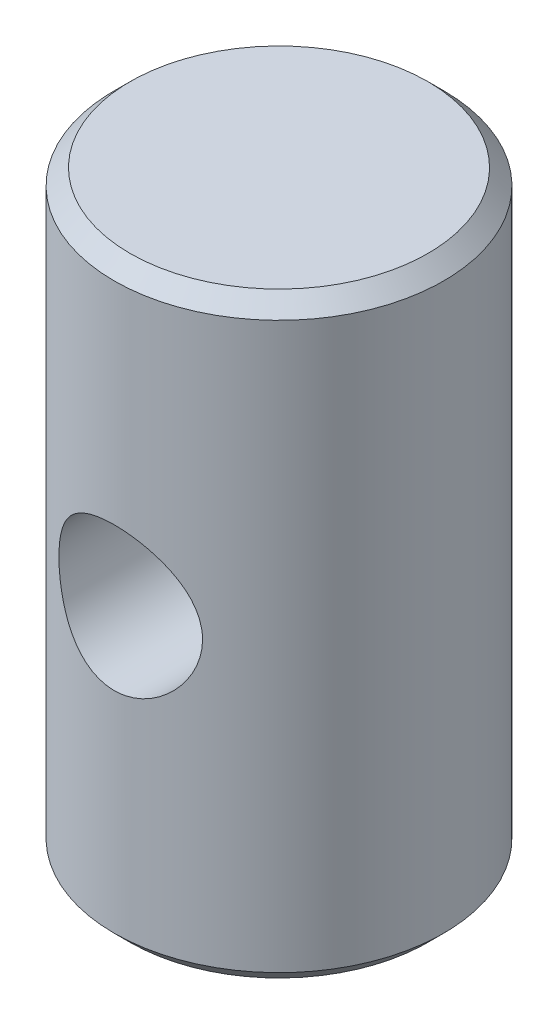
ISO-10303-21;
HEADER;
FILE_DESCRIPTION(('STEP AP214'),'2;1');
FILE_NAME('part.step','',(''),(''),'','','');
FILE_SCHEMA(('AUTOMOTIVE_DESIGN { 1 0 10303 214 1 1 1 1 }'));
ENDSEC;
DATA;
#1=APPLICATION_CONTEXT('core data for automotive mechanical design processes');
#2=APPLICATION_PROTOCOL_DEFINITION('international standard','automotive_design',2000,#1);
#3=PRODUCT_CONTEXT('',#1,'mechanical');
#4=PRODUCT('Part','Part','',(#3));
#5=PRODUCT_RELATED_PRODUCT_CATEGORY('part','',(#4));
#6=PRODUCT_DEFINITION_FORMATION('','',#4);
#7=PRODUCT_DEFINITION_CONTEXT('part definition',#1,'design');
#8=PRODUCT_DEFINITION('design','',#6,#7);
#9=PRODUCT_DEFINITION_SHAPE('','',#8);
#10=(LENGTH_UNIT() NAMED_UNIT(*) SI_UNIT(.MILLI.,.METRE.));
#11=(NAMED_UNIT(*) PLANE_ANGLE_UNIT() SI_UNIT($,.RADIAN.));
#12=(NAMED_UNIT(*) SI_UNIT($,.STERADIAN.) SOLID_ANGLE_UNIT());
#13=UNCERTAINTY_MEASURE_WITH_UNIT(LENGTH_MEASURE(1.E-05),#10,'distance_accuracy_value','');
#14=(GEOMETRIC_REPRESENTATION_CONTEXT(3) GLOBAL_UNCERTAINTY_ASSIGNED_CONTEXT((#13)) GLOBAL_UNIT_ASSIGNED_CONTEXT((#10,
#11,#12)) REPRESENTATION_CONTEXT('',''));
#15=CARTESIAN_POINT('',(0.,0.,0.));
#16=DIRECTION('',(0.,0.,1.));
#17=DIRECTION('',(1.,0.,0.));
#18=AXIS2_PLACEMENT_3D('',#15,#16,#17);
#19=CARTESIAN_POINT('',(0.,14.351,0.));
#20=DIRECTION('',(0.,-1.,0.));
#21=DIRECTION('',(0.,0.,-1.00000000000001));
#22=AXIS2_PLACEMENT_3D('',#19,#20,#21);
#23=CYLINDRICAL_SURFACE('',#22,3.9624);
#24=CARTESIAN_POINT('',(1.7272,7.1628,3.56614552703619));
#25=CARTESIAN_POINT('',(1.72719589741112,7.07113387059166,3.56614993077741));
#26=CARTESIAN_POINT('',(1.7198563547776,6.9793146178966,3.56973092522894));
#27=CARTESIAN_POINT('',(1.69081256466766,6.79836471975493,3.58357547788537));
#28=CARTESIAN_POINT('',(1.66907105976062,6.70924167628412,3.59385636739065));
#29=CARTESIAN_POINT('',(1.61224827694549,6.53662551523054,3.6197002139196));
#30=CARTESIAN_POINT('',(1.57722487269375,6.4531097970809,3.63524022403528));
#31=CARTESIAN_POINT('',(1.49500578565154,6.29316182054083,3.6698165066083));
#32=CARTESIAN_POINT('',(1.44781218552928,6.21672835321407,3.68885218069736));
#33=CARTESIAN_POINT('',(1.33915027419396,6.06785473138359,3.72972629681705));
#34=CARTESIAN_POINT('',(1.27697890078481,5.99595508122913,3.75166530796737));
#35=CARTESIAN_POINT('',(1.14159970539789,5.8631987124269,3.79505136644031));
#36=CARTESIAN_POINT('',(1.06838740960764,5.80234649235768,3.81649821025789));
#37=CARTESIAN_POINT('',(0.908670114004449,5.69056161394339,3.85772570091536));
#38=CARTESIAN_POINT('',(0.821694106038829,5.64024944000791,3.8773759773678));
#39=CARTESIAN_POINT('',(0.639499839563152,5.55520813096962,3.91154996359956));
#40=CARTESIAN_POINT('',(0.544285594873898,5.52047145763201,3.92607615260837));
#41=CARTESIAN_POINT('',(0.354004474453539,5.46956458647761,3.94764982511966));
#42=CARTESIAN_POINT('',(0.259231279574775,5.45245895379762,3.95507241461706));
#43=CARTESIAN_POINT('',(0.0678890738924124,5.43426453734702,3.96297326142524));
#44=CARTESIAN_POINT('',(-0.0286791157575748,5.43316860182497,3.96345461947812));
#45=CARTESIAN_POINT('',(-0.214019931292419,5.44656196520325,3.95763057708475));
#46=CARTESIAN_POINT('',(-0.302883957933032,5.46001982846568,3.95177430819682));
#47=CARTESIAN_POINT('',(-0.476944676567913,5.50035407791297,3.9345633932956));
#48=CARTESIAN_POINT('',(-0.562141096735375,5.52723145683962,3.92320834049806));
#49=CARTESIAN_POINT('',(-0.728026639089416,5.5939421456383,3.89586603541677));
#50=CARTESIAN_POINT('',(-0.808626905603861,5.63396730489782,3.87981059847104));
#51=CARTESIAN_POINT('',(-0.962179080061302,5.72563783228495,3.84461178823216));
#52=CARTESIAN_POINT('',(-1.03512820484004,5.77728740754322,3.82546729765475));
#53=CARTESIAN_POINT('',(-1.17721181969115,5.89529983549194,3.78426569350377));
#54=CARTESIAN_POINT('',(-1.24563357525797,5.96248324454073,3.76209779908373));
#55=CARTESIAN_POINT('',(-1.37056544109138,6.10737251655165,3.71840738174161));
#56=CARTESIAN_POINT('',(-1.42707005457811,6.18508320819918,3.69688516054489));
#57=CARTESIAN_POINT('',(-1.52864446774681,6.35260056060402,3.6560878177876));
#58=CARTESIAN_POINT('',(-1.57318542786003,6.44275959623804,3.63693230997906));
#59=CARTESIAN_POINT('',(-1.64615514374342,6.63035261029733,3.60449719801011));
#60=CARTESIAN_POINT('',(-1.67459667664862,6.72778074997144,3.59121293604018));
#61=CARTESIAN_POINT('',(-1.71265446245399,6.91998586667292,3.57321211924261));
#62=CARTESIAN_POINT('',(-1.72343422801932,7.01448193413677,3.5679676487184));
#63=CARTESIAN_POINT('',(-1.72930635611275,7.20405814926641,3.56512687568415));
#64=CARTESIAN_POINT('',(-1.72440506063363,7.29913804528603,3.56752748122483));
#65=CARTESIAN_POINT('',(-1.70011832298708,7.4798545126876,3.57915692676073));
#66=CARTESIAN_POINT('',(-1.68181579551822,7.56567392560942,3.58787477116406));
#67=CARTESIAN_POINT('',(-1.63271771102619,7.73293532205738,3.61048078266554));
#68=CARTESIAN_POINT('',(-1.60191904401185,7.81437621015467,3.62437023678315));
#69=CARTESIAN_POINT('',(-1.52720876846257,7.97459431983546,3.65649623494317));
#70=CARTESIAN_POINT('',(-1.48277877423513,8.05309568427869,3.67489747406087));
#71=CARTESIAN_POINT('',(-1.38256674795294,8.20192765054499,3.71375937788474));
#72=CARTESIAN_POINT('',(-1.32677949731933,8.27225447280262,3.73422098712416));
#73=CARTESIAN_POINT('',(-1.19948482874215,8.40938735909963,3.77713548868492));
#74=CARTESIAN_POINT('',(-1.12701063383753,8.47529586406847,3.79960069661502));
#75=CARTESIAN_POINT('',(-0.971535731074503,8.59420328023159,3.84229423811627));
#76=CARTESIAN_POINT('',(-0.888533778841651,8.64720066317279,3.86252230672896));
#77=CARTESIAN_POINT('',(-0.71336397284965,8.73892270332071,3.89868757505322));
#78=CARTESIAN_POINT('',(-0.621139909518709,8.77755209321189,3.91459595172678));
#79=CARTESIAN_POINT('',(-0.430623283302369,8.83843900311843,3.94010004882491));
#80=CARTESIAN_POINT('',(-0.332334757521398,8.86070728991486,3.949699920259));
#81=CARTESIAN_POINT('',(-0.140461012272615,8.88679276605566,3.96098741868396));
#82=CARTESIAN_POINT('',(-0.0470781868625263,8.89187193505369,3.96321592377826));
#83=CARTESIAN_POINT('',(0.139194491913484,8.88689964312438,3.96104868747176));
#84=CARTESIAN_POINT('',(0.232084442924306,8.87685130073712,3.9566543113793));
#85=CARTESIAN_POINT('',(0.410738348901372,8.84281299069729,3.94203210863178));
#86=CARTESIAN_POINT('',(0.496638051959682,8.81941893219931,3.9320539492743));
#87=CARTESIAN_POINT('',(0.663238778514841,8.76003495200585,3.90740654114817));
#88=CARTESIAN_POINT('',(0.743938862312734,8.72404276103657,3.89273644727282));
#89=CARTESIAN_POINT('',(0.901932977314789,8.6386613837307,3.8592680887012));
#90=CARTESIAN_POINT('',(0.978901999050526,8.58873436390756,3.84031159534644));
#91=CARTESIAN_POINT('',(1.12370588773836,8.47765374175666,3.80046684162582));
#92=CARTESIAN_POINT('',(1.19153699805237,8.41649554650857,3.77957779269373));
#93=CARTESIAN_POINT('',(1.32148064662441,8.2792666195578,3.73622039367742));
#94=CARTESIAN_POINT('',(1.38277531468479,8.20241879921603,3.71375182625651));
#95=CARTESIAN_POINT('',(1.49175885005103,8.03888803959137,3.67133506488779));
#96=CARTESIAN_POINT('',(1.53943955533864,7.95219924366032,3.6513883868714));
#97=CARTESIAN_POINT('',(1.61960506634972,7.77101173405566,3.6165475054073));
#98=CARTESIAN_POINT('',(1.65207959254431,7.67650778789674,3.60165672165856));
#99=CARTESIAN_POINT('',(1.70023951426616,7.4826606357442,3.57917968442231));
#100=CARTESIAN_POINT('',(1.71598123416852,7.38333484894709,3.57156893429836));
#101=CARTESIAN_POINT('',(1.72438769192046,7.26337632757507,3.56750597176857));
#102=CARTESIAN_POINT('',(1.72544131653242,7.24328107414503,3.5669968427177));
#103=CARTESIAN_POINT('',(1.72684792846381,7.2030596765425,3.56631613319409));
#104=CARTESIAN_POINT('',(1.72720090109186,7.18293353173113,3.56614455979928));
#105=CARTESIAN_POINT('',(1.7272,7.1628,3.56614552703619));
#106=B_SPLINE_CURVE_WITH_KNOTS('',3,(#24,#25,#26,#27,#28,#29,#30,#31,#32,#33,#34,#35,#36,#37,
#38,#39,#40,#41,#42,#43,#44,#45,#46,#47,#48,#49,#50,#51,#52,#53,#54,#55,#56,#57,#58,#59,#60,#61,
#62,#63,#64,#65,#66,#67,#68,#69,#70,#71,#72,#73,#74,#75,#76,#77,#78,#79,#80,#81,#82,#83,#84,#85,
#86,#87,#88,#89,#90,#91,#92,#93,#94,#95,#96,#97,#98,#99,#100,#101,#102,#103,#104,#105),
.UNSPECIFIED.,.T.,.F.,(4,2,2,2,2,2,2,2,2,2,2,2,2,2,2,2,2,2,2,2,2,2,2,2,2,2,2,2,2,2,2,2,2,2,2,2,
2,2,2,2,4),(0.,0.27491360060961,0.550541186246354,0.824981319003142,1.09937451834223,
1.39076193437484,1.68226774023017,1.98784235201367,2.29326891166307,2.5814948127249,
2.8695919553817,3.13853317485298,3.40749429286321,3.68056864002003,3.9537419781475,
4.24770338801559,4.54180009242742,4.84730969142455,5.15257648487916,5.43678031040862,
5.72086920808197,5.98422984023226,6.24765605680785,6.52269943356456,6.79786947721351,
7.0979920914505,7.39815021311259,7.7002644872138,8.00217976991365,8.28138332266198,
8.5605293254123,8.82809027882379,9.09569945222211,9.37555849602337,9.65553224235743,
9.9566345983025,10.2579170977655,10.5594029742113,10.8598707724349,10.9202514788341,
10.9806334512913),.UNSPECIFIED.);
#107=CARTESIAN_POINT('',(1.7272,7.1628,3.56614552703619));
#108=VERTEX_POINT('',#107);
#109=EDGE_CURVE('E40',#108,#108,#106,.T.);
#110=ORIENTED_EDGE('',*,*,#109,.T.);
#111=EDGE_LOOP('',(#110));
#112=FACE_BOUND('',#111,.T.);
#113=CARTESIAN_POINT('',(0.,0.381000000000003,0.));
#114=DIRECTION('',(0.,1.,0.));
#115=DIRECTION('',(0.,0.,1.00000000000001));
#116=AXIS2_PLACEMENT_3D('',#113,#114,#115);
#117=CIRCLE('',#116,3.9624);
#118=CARTESIAN_POINT('',(0.,0.381000000000003,3.96240000000002));
#119=VERTEX_POINT('',#118);
#120=EDGE_CURVE('E67',#119,#119,#117,.T.);
#121=ORIENTED_EDGE('',*,*,#120,.T.);
#122=EDGE_LOOP('',(#121));
#123=FACE_BOUND('',#122,.T.);
#124=CARTESIAN_POINT('',(0.,13.97,0.));
#125=DIRECTION('',(0.,1.,0.));
#126=DIRECTION('',(0.,0.,1.00000000000001));
#127=AXIS2_PLACEMENT_3D('',#124,#125,#126);
#128=CIRCLE('',#127,3.9624);
#129=CARTESIAN_POINT('',(0.,13.97,3.96240000000002));
#130=VERTEX_POINT('',#129);
#131=EDGE_CURVE('E63',#130,#130,#128,.F.);
#132=ORIENTED_EDGE('',*,*,#131,.T.);
#133=EDGE_LOOP('',(#132));
#134=FACE_BOUND('',#133,.T.);
#135=ADVANCED_FACE('F36',(#112,#123,#134),#23,.T.);
#136=CARTESIAN_POINT('',(0.,14.351,0.));
#137=DIRECTION('',(0.,1.,0.));
#138=DIRECTION('',(0.,0.,1.00000000000001));
#139=AXIS2_PLACEMENT_3D('',#136,#137,#138);
#140=PLANE('',#139);
#141=CARTESIAN_POINT('',(0.,14.351,0.));
#142=DIRECTION('',(0.,1.,0.));
#143=DIRECTION('',(0.,0.,1.00000000000001));
#144=AXIS2_PLACEMENT_3D('',#141,#142,#143);
#145=CIRCLE('',#144,3.5814);
#146=CARTESIAN_POINT('',(0.,14.351,3.58140000000002));
#147=VERTEX_POINT('',#146);
#148=EDGE_CURVE('E11',#147,#147,#145,.T.);
#149=ORIENTED_EDGE('',*,*,#148,.T.);
#150=EDGE_LOOP('',(#149));
#151=FACE_BOUND('',#150,.T.);
#152=ADVANCED_FACE('F82',(#151),#140,.T.);
#153=CARTESIAN_POINT('',(0.,0.,0.));
#154=DIRECTION('',(0.,1.,0.));
#155=DIRECTION('',(0.,0.,1.00000000000001));
#156=AXIS2_PLACEMENT_3D('',#153,#154,#155);
#157=PLANE('',#156);
#158=CARTESIAN_POINT('',(0.,0.,0.));
#159=DIRECTION('',(0.,1.,0.));
#160=DIRECTION('',(0.,0.,1.00000000000001));
#161=AXIS2_PLACEMENT_3D('',#158,#159,#160);
#162=CIRCLE('',#161,3.5814);
#163=CARTESIAN_POINT('',(0.,0.,3.58140000000002));
#164=VERTEX_POINT('',#163);
#165=EDGE_CURVE('E49',#164,#164,#162,.F.);
#166=ORIENTED_EDGE('',*,*,#165,.T.);
#167=EDGE_LOOP('',(#166));
#168=FACE_BOUND('',#167,.T.);
#169=ADVANCED_FACE('F73',(#168),#157,.F.);
#170=CARTESIAN_POINT('',(0.,0.381000000000003,0.));
#171=DIRECTION('',(0.,1.,0.));
#172=DIRECTION('',(0.,0.,1.00000000000001));
#173=AXIS2_PLACEMENT_3D('',#170,#171,#172);
#174=CONICAL_SURFACE('',#173,3.9624,0.785398163397448);
#175=ORIENTED_EDGE('',*,*,#165,.F.);
#176=EDGE_LOOP('',(#175));
#177=FACE_BOUND('',#176,.T.);
#178=ORIENTED_EDGE('',*,*,#120,.F.);
#179=EDGE_LOOP('',(#178));
#180=FACE_BOUND('',#179,.T.);
#181=ADVANCED_FACE('F75',(#177,#180),#174,.T.);
#182=CARTESIAN_POINT('',(0.,14.351,0.));
#183=DIRECTION('',(0.,-1.,0.));
#184=DIRECTION('',(0.,0.,-1.00000000000001));
#185=AXIS2_PLACEMENT_3D('',#182,#183,#184);
#186=CONICAL_SURFACE('',#185,3.5814,0.785398163397439);
#187=ORIENTED_EDGE('',*,*,#131,.F.);
#188=EDGE_LOOP('',(#187));
#189=FACE_BOUND('',#188,.T.);
#190=ORIENTED_EDGE('',*,*,#148,.F.);
#191=EDGE_LOOP('',(#190));
#192=FACE_BOUND('',#191,.T.);
#193=ADVANCED_FACE('F38',(#189,#192),#186,.T.);
#194=CARTESIAN_POINT('',(0.,7.1628,3.96875000000002));
#195=DIRECTION('',(0.,0.,1.00000000000001));
#196=DIRECTION('',(1.00000000000001,0.,0.));
#197=AXIS2_PLACEMENT_3D('',#194,#195,#196);
#198=CYLINDRICAL_SURFACE('',#197,1.72719999999999);
#199=CARTESIAN_POINT('',(0.,7.1628,-2.38125000000002));
#200=DIRECTION('',(0.,0.,1.00000000000001));
#201=DIRECTION('',(1.00000000000001,0.,0.));
#202=AXIS2_PLACEMENT_3D('',#199,#200,#201);
#203=CIRCLE('',#202,1.72719999999999);
#204=CARTESIAN_POINT('',(1.72719999999999,7.1628,-2.38125000000002));
#205=VERTEX_POINT('',#204);
#206=EDGE_CURVE('E59',#205,#205,#203,.T.);
#207=ORIENTED_EDGE('',*,*,#206,.F.);
#208=EDGE_LOOP('',(#207));
#209=FACE_BOUND('',#208,.T.);
#210=ORIENTED_EDGE('',*,*,#109,.F.);
#211=EDGE_LOOP('',(#210));
#212=FACE_BOUND('',#211,.T.);
#213=ADVANCED_FACE('F55',(#209,#212),#198,.F.);
#214=CARTESIAN_POINT('',(0.,7.1628,-2.38125000000002));
#215=DIRECTION('',(0.,0.,1.00000000000001));
#216=DIRECTION('',(1.00000000000001,0.,0.));
#217=AXIS2_PLACEMENT_3D('',#214,#215,#216);
#218=CONICAL_SURFACE('',#217,1.72719999999999,1.02974425867665);
#219=CARTESIAN_POINT('',(0.,7.1628,-3.41905646118443));
#220=VERTEX_POINT('',#219);
#221=VERTEX_LOOP('',#220);
#222=FACE_BOUND('',#221,.T.);
#223=ORIENTED_EDGE('',*,*,#206,.T.);
#224=EDGE_LOOP('',(#223));
#225=FACE_BOUND('',#224,.T.);
#226=ADVANCED_FACE('F52',(#222,#225),#218,.F.);
#227=CLOSED_SHELL('',(#135,#152,#169,#181,#193,#213,#226));
#228=MANIFOLD_SOLID_BREP('B2',#227);
#229=ADVANCED_BREP_SHAPE_REPRESENTATION('',(#18,#228),#14);
#230=SHAPE_DEFINITION_REPRESENTATION(#9,#229);
ENDSEC;
END-ISO-10303-21;
